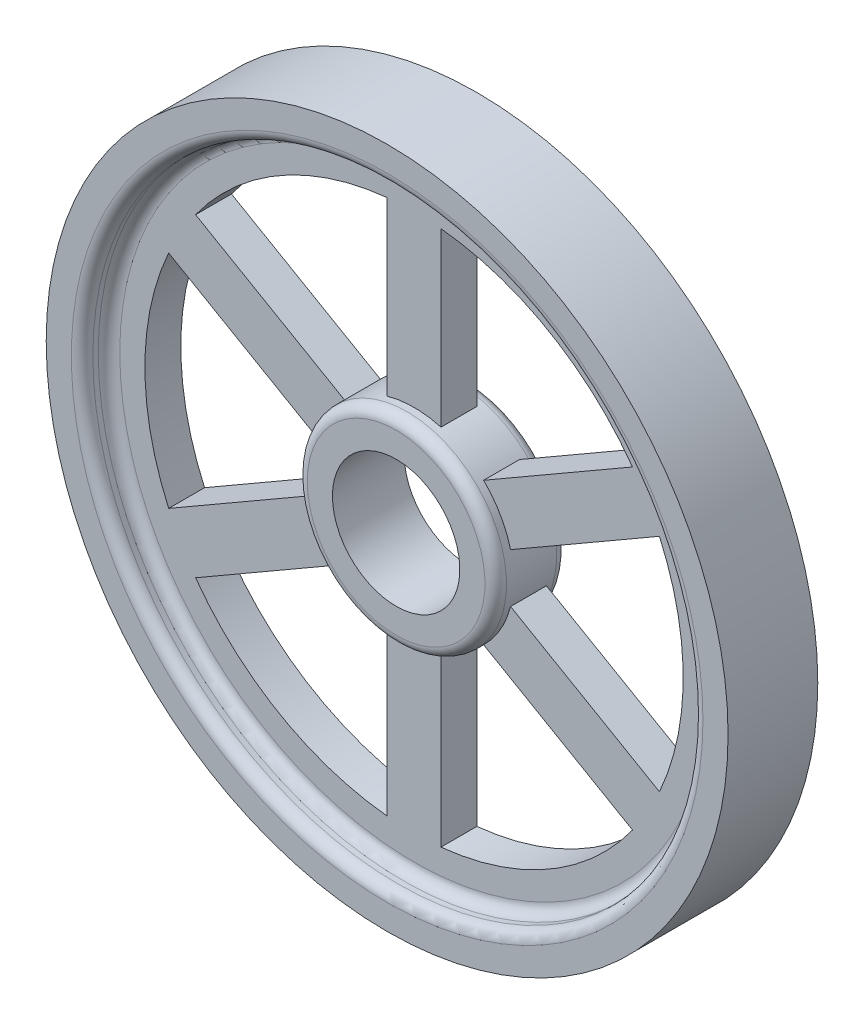
ISO-10303-21;
HEADER;
FILE_DESCRIPTION(('STEP AP214'),'2;1');
FILE_NAME('part.step','',(''),(''),'','','');
FILE_SCHEMA(('AUTOMOTIVE_DESIGN { 1 0 10303 214 1 1 1 1 }'));
ENDSEC;
DATA;
#1=APPLICATION_CONTEXT('core data for automotive mechanical design processes');
#2=APPLICATION_PROTOCOL_DEFINITION('international standard','automotive_design',2000,#1);
#3=PRODUCT_CONTEXT('',#1,'mechanical');
#4=PRODUCT('Part','Part','',(#3));
#5=PRODUCT_RELATED_PRODUCT_CATEGORY('part','',(#4));
#6=PRODUCT_DEFINITION_FORMATION('','',#4);
#7=PRODUCT_DEFINITION_CONTEXT('part definition',#1,'design');
#8=PRODUCT_DEFINITION('design','',#6,#7);
#9=PRODUCT_DEFINITION_SHAPE('','',#8);
#10=(LENGTH_UNIT() NAMED_UNIT(*) SI_UNIT(.MILLI.,.METRE.));
#11=(NAMED_UNIT(*) PLANE_ANGLE_UNIT() SI_UNIT($,.RADIAN.));
#12=(NAMED_UNIT(*) SI_UNIT($,.STERADIAN.) SOLID_ANGLE_UNIT());
#13=UNCERTAINTY_MEASURE_WITH_UNIT(LENGTH_MEASURE(1.E-05),#10,'distance_accuracy_value','');
#14=(GEOMETRIC_REPRESENTATION_CONTEXT(3) GLOBAL_UNCERTAINTY_ASSIGNED_CONTEXT((#13)) GLOBAL_UNIT_ASSIGNED_CONTEXT((#10,
#11,#12)) REPRESENTATION_CONTEXT('',''));
#15=CARTESIAN_POINT('',(0.,0.,0.));
#16=DIRECTION('',(0.,0.,1.));
#17=DIRECTION('',(1.,0.,0.));
#18=AXIS2_PLACEMENT_3D('',#15,#16,#17);
#19=CARTESIAN_POINT('',(0.,0.,22.5));
#20=DIRECTION('',(0.,0.,-1.));
#21=DIRECTION('',(-1.,0.,0.));
#22=AXIS2_PLACEMENT_3D('',#19,#20,#21);
#23=CYLINDRICAL_SURFACE('',#22,27.75);
#24=CARTESIAN_POINT('',(0.,0.,5.5));
#25=DIRECTION('',(0.,0.,-1.));
#26=DIRECTION('',(-1.,0.,0.));
#27=AXIS2_PLACEMENT_3D('',#24,#25,#26);
#28=CIRCLE('',#27,27.75);
#29=CARTESIAN_POINT('',(-27.75,0.,5.5));
#30=VERTEX_POINT('',#29);
#31=EDGE_CURVE('E470',#30,#30,#28,.F.);
#32=ORIENTED_EDGE('',*,*,#31,.T.);
#33=EDGE_LOOP('',(#32));
#34=FACE_BOUND('',#33,.T.);
#35=CARTESIAN_POINT('',(0.,0.,19.5));
#36=DIRECTION('',(0.,0.,-1.));
#37=DIRECTION('',(-1.,0.,0.));
#38=AXIS2_PLACEMENT_3D('',#35,#36,#37);
#39=CIRCLE('',#38,27.75);
#40=CARTESIAN_POINT('',(-27.75,0.,19.5));
#41=VERTEX_POINT('',#40);
#42=EDGE_CURVE('E466',#41,#41,#39,.T.);
#43=ORIENTED_EDGE('',*,*,#42,.T.);
#44=EDGE_LOOP('',(#43));
#45=FACE_BOUND('',#44,.T.);
#46=DIRECTION('',(0.,0.,-1.));
#47=VECTOR('',#46,1.);
#48=CARTESIAN_POINT('',(7.5,26.7172696958353,17.5));
#49=LINE('',#48,#47);
#50=CARTESIAN_POINT('',(7.5,26.7172696958353,17.5));
#51=VERTEX_POINT('',#50);
#52=CARTESIAN_POINT('',(7.5,26.7172696958353,7.5));
#53=VERTEX_POINT('',#52);
#54=EDGE_CURVE('E448',#51,#53,#49,.T.);
#55=ORIENTED_EDGE('',*,*,#54,.F.);
#56=CARTESIAN_POINT('',(0.,0.,17.5));
#57=DIRECTION('',(0.,0.,1.));
#58=DIRECTION('',(-1.,0.,0.));
#59=AXIS2_PLACEMENT_3D('',#56,#57,#58);
#60=CIRCLE('',#59,27.75);
#61=CARTESIAN_POINT('',(-7.5,26.7172696958353,17.5));
#62=VERTEX_POINT('',#61);
#63=EDGE_CURVE('E432',#51,#62,#60,.T.);
#64=ORIENTED_EDGE('',*,*,#63,.T.);
#65=DIRECTION('',(0.,0.,-1.));
#66=VECTOR('',#65,1.);
#67=CARTESIAN_POINT('',(-7.5,26.7172696958353,17.5));
#68=LINE('',#67,#66);
#69=CARTESIAN_POINT('',(-7.5,26.7172696958353,7.5));
#70=VERTEX_POINT('',#69);
#71=EDGE_CURVE('E445',#62,#70,#68,.T.);
#72=ORIENTED_EDGE('',*,*,#71,.T.);
#73=CARTESIAN_POINT('',(0.,0.,7.5));
#74=DIRECTION('',(0.,0.,1.));
#75=DIRECTION('',(-1.,0.,0.));
#76=AXIS2_PLACEMENT_3D('',#73,#74,#75);
#77=CIRCLE('',#76,27.75);
#78=EDGE_CURVE('E421',#53,#70,#77,.T.);
#79=ORIENTED_EDGE('',*,*,#78,.F.);
#80=EDGE_LOOP('',(#55,#64,#72,#79));
#81=FACE_BOUND('',#80,.T.);
#82=DIRECTION('',(0.,0.,-1.));
#83=VECTOR('',#82,1.);
#84=CARTESIAN_POINT('',(-19.3878342763536,19.8538253763009,17.5));
#85=LINE('',#84,#83);
#86=CARTESIAN_POINT('',(-19.3878342763536,19.8538253763009,17.5));
#87=VERTEX_POINT('',#86);
#88=CARTESIAN_POINT('',(-19.3878342763536,19.8538253763009,7.5));
#89=VERTEX_POINT('',#88);
#90=EDGE_CURVE('E396',#87,#89,#85,.T.);
#91=ORIENTED_EDGE('',*,*,#90,.F.);
#92=CARTESIAN_POINT('',(0.,0.,17.5));
#93=DIRECTION('',(0.,0.,1.));
#94=DIRECTION('',(-0.499999999999998,-0.86602540378444,0.));
#95=AXIS2_PLACEMENT_3D('',#92,#93,#94);
#96=CIRCLE('',#95,27.75);
#97=CARTESIAN_POINT('',(-26.8878342763535,6.8634443195343,17.5));
#98=VERTEX_POINT('',#97);
#99=EDGE_CURVE('E380',#87,#98,#96,.T.);
#100=ORIENTED_EDGE('',*,*,#99,.T.);
#101=DIRECTION('',(0.,0.,-1.));
#102=VECTOR('',#101,1.);
#103=CARTESIAN_POINT('',(-26.8878342763535,6.86344431953431,17.5));
#104=LINE('',#103,#102);
#105=CARTESIAN_POINT('',(-26.8878342763535,6.86344431953431,7.5));
#106=VERTEX_POINT('',#105);
#107=EDGE_CURVE('E393',#98,#106,#104,.T.);
#108=ORIENTED_EDGE('',*,*,#107,.T.);
#109=CARTESIAN_POINT('',(0.,0.,7.5));
#110=DIRECTION('',(0.,0.,1.));
#111=DIRECTION('',(-0.499999999999998,-0.86602540378444,0.));
#112=AXIS2_PLACEMENT_3D('',#109,#110,#111);
#113=CIRCLE('',#112,27.75);
#114=EDGE_CURVE('E368',#89,#106,#113,.T.);
#115=ORIENTED_EDGE('',*,*,#114,.F.);
#116=EDGE_LOOP('',(#91,#100,#108,#115));
#117=FACE_BOUND('',#116,.T.);
#118=DIRECTION('',(0.,0.,-1.));
#119=VECTOR('',#118,1.);
#120=CARTESIAN_POINT('',(-26.8878342763535,-6.8634443195345,17.5));
#121=LINE('',#120,#119);
#122=CARTESIAN_POINT('',(-26.8878342763535,-6.86344431953449,17.5));
#123=VERTEX_POINT('',#122);
#124=CARTESIAN_POINT('',(-26.8878342763535,-6.86344431953449,7.5));
#125=VERTEX_POINT('',#124);
#126=EDGE_CURVE('E358',#123,#125,#121,.T.);
#127=ORIENTED_EDGE('',*,*,#126,.F.);
#128=CARTESIAN_POINT('',(0.,0.,17.5));
#129=DIRECTION('',(0.,0.,1.));
#130=DIRECTION('',(0.500000000000004,-0.866025403784436,0.));
#131=AXIS2_PLACEMENT_3D('',#128,#129,#130);
#132=CIRCLE('',#131,27.75);
#133=CARTESIAN_POINT('',(-19.3878342763534,-19.853825376301,17.5));
#134=VERTEX_POINT('',#133);
#135=EDGE_CURVE('E342',#123,#134,#132,.T.);
#136=ORIENTED_EDGE('',*,*,#135,.T.);
#137=DIRECTION('',(0.,0.,-1.));
#138=VECTOR('',#137,1.);
#139=CARTESIAN_POINT('',(-19.3878342763534,-19.853825376301,17.5));
#140=LINE('',#139,#138);
#141=CARTESIAN_POINT('',(-19.3878342763534,-19.853825376301,7.5));
#142=VERTEX_POINT('',#141);
#143=EDGE_CURVE('E355',#134,#142,#140,.T.);
#144=ORIENTED_EDGE('',*,*,#143,.T.);
#145=CARTESIAN_POINT('',(0.,0.,7.5));
#146=DIRECTION('',(0.,0.,1.));
#147=DIRECTION('',(0.500000000000004,-0.866025403784436,0.));
#148=AXIS2_PLACEMENT_3D('',#145,#146,#147);
#149=CIRCLE('',#148,27.75);
#150=EDGE_CURVE('E330',#125,#142,#149,.T.);
#151=ORIENTED_EDGE('',*,*,#150,.F.);
#152=EDGE_LOOP('',(#127,#136,#144,#151));
#153=FACE_BOUND('',#152,.T.);
#154=DIRECTION('',(0.,0.,-1.));
#155=VECTOR('',#154,1.);
#156=CARTESIAN_POINT('',(-7.5,-26.7172696958353,17.5));
#157=LINE('',#156,#155);
#158=CARTESIAN_POINT('',(-7.5,-26.7172696958353,17.5));
#159=VERTEX_POINT('',#158);
#160=CARTESIAN_POINT('',(-7.5,-26.7172696958353,7.5));
#161=VERTEX_POINT('',#160);
#162=EDGE_CURVE('E320',#159,#161,#157,.T.);
#163=ORIENTED_EDGE('',*,*,#162,.F.);
#164=CARTESIAN_POINT('',(0.,0.,17.5));
#165=DIRECTION('',(0.,0.,1.));
#166=DIRECTION('',(1.,0.,0.));
#167=AXIS2_PLACEMENT_3D('',#164,#165,#166);
#168=CIRCLE('',#167,27.75);
#169=CARTESIAN_POINT('',(7.5,-26.7172696958353,17.5));
#170=VERTEX_POINT('',#169);
#171=EDGE_CURVE('E304',#159,#170,#168,.T.);
#172=ORIENTED_EDGE('',*,*,#171,.T.);
#173=DIRECTION('',(0.,0.,-1.));
#174=VECTOR('',#173,1.);
#175=CARTESIAN_POINT('',(7.5,-26.7172696958353,17.5));
#176=LINE('',#175,#174);
#177=CARTESIAN_POINT('',(7.5,-26.7172696958353,7.5));
#178=VERTEX_POINT('',#177);
#179=EDGE_CURVE('E317',#170,#178,#176,.T.);
#180=ORIENTED_EDGE('',*,*,#179,.T.);
#181=CARTESIAN_POINT('',(0.,0.,7.5));
#182=DIRECTION('',(0.,0.,1.));
#183=DIRECTION('',(1.,0.,0.));
#184=AXIS2_PLACEMENT_3D('',#181,#182,#183);
#185=CIRCLE('',#184,27.75);
#186=EDGE_CURVE('E292',#161,#178,#185,.T.);
#187=ORIENTED_EDGE('',*,*,#186,.F.);
#188=EDGE_LOOP('',(#163,#172,#180,#187));
#189=FACE_BOUND('',#188,.T.);
#190=DIRECTION('',(0.,0.,-1.));
#191=VECTOR('',#190,1.);
#192=CARTESIAN_POINT('',(19.3878342763537,-19.8538253763008,17.5));
#193=LINE('',#192,#191);
#194=CARTESIAN_POINT('',(19.3878342763537,-19.8538253763008,17.5));
#195=VERTEX_POINT('',#194);
#196=CARTESIAN_POINT('',(19.3878342763537,-19.8538253763008,7.5));
#197=VERTEX_POINT('',#196);
#198=EDGE_CURVE('E282',#195,#197,#193,.T.);
#199=ORIENTED_EDGE('',*,*,#198,.F.);
#200=CARTESIAN_POINT('',(0.,0.,17.5));
#201=DIRECTION('',(0.,0.,1.));
#202=DIRECTION('',(0.499999999999992,0.866025403784443,0.));
#203=AXIS2_PLACEMENT_3D('',#200,#201,#202);
#204=CIRCLE('',#203,27.75);
#205=CARTESIAN_POINT('',(26.8878342763536,-6.86344431953412,17.5));
#206=VERTEX_POINT('',#205);
#207=EDGE_CURVE('E267',#195,#206,#204,.T.);
#208=ORIENTED_EDGE('',*,*,#207,.T.);
#209=DIRECTION('',(0.,0.,-1.));
#210=VECTOR('',#209,1.);
#211=CARTESIAN_POINT('',(26.8878342763536,-6.86344431953412,17.5));
#212=LINE('',#211,#210);
#213=CARTESIAN_POINT('',(26.8878342763536,-6.86344431953412,7.5));
#214=VERTEX_POINT('',#213);
#215=EDGE_CURVE('E279',#206,#214,#212,.T.);
#216=ORIENTED_EDGE('',*,*,#215,.T.);
#217=CARTESIAN_POINT('',(0.,0.,7.5));
#218=DIRECTION('',(0.,0.,1.));
#219=DIRECTION('',(0.499999999999992,0.866025403784443,0.));
#220=AXIS2_PLACEMENT_3D('',#217,#218,#219);
#221=CIRCLE('',#220,27.75);
#222=EDGE_CURVE('E258',#197,#214,#221,.T.);
#223=ORIENTED_EDGE('',*,*,#222,.F.);
#224=EDGE_LOOP('',(#199,#208,#216,#223));
#225=FACE_BOUND('',#224,.T.);
#226=DIRECTION('',(0.,0.,-1.));
#227=VECTOR('',#226,1.);
#228=CARTESIAN_POINT('',(26.8878342763534,6.86344431953468,17.5));
#229=LINE('',#228,#227);
#230=CARTESIAN_POINT('',(26.8878342763534,6.86344431953468,17.5));
#231=VERTEX_POINT('',#230);
#232=CARTESIAN_POINT('',(26.8878342763534,6.86344431953468,7.5));
#233=VERTEX_POINT('',#232);
#234=EDGE_CURVE('E60',#231,#233,#229,.T.);
#235=ORIENTED_EDGE('',*,*,#234,.F.);
#236=CARTESIAN_POINT('',(0.,0.,17.5));
#237=DIRECTION('',(0.,0.,1.));
#238=DIRECTION('',(-0.50000000000001,0.866025403784433,0.));
#239=AXIS2_PLACEMENT_3D('',#236,#237,#238);
#240=CIRCLE('',#239,27.75);
#241=CARTESIAN_POINT('',(19.3878342763533,19.8538253763012,17.5));
#242=VERTEX_POINT('',#241);
#243=EDGE_CURVE('E55',#231,#242,#240,.T.);
#244=ORIENTED_EDGE('',*,*,#243,.T.);
#245=DIRECTION('',(0.,0.,-1.));
#246=VECTOR('',#245,1.);
#247=CARTESIAN_POINT('',(19.3878342763533,19.8538253763012,17.5));
#248=LINE('',#247,#246);
#249=CARTESIAN_POINT('',(19.3878342763533,19.8538253763012,7.5));
#250=VERTEX_POINT('',#249);
#251=EDGE_CURVE('E250',#242,#250,#248,.T.);
#252=ORIENTED_EDGE('',*,*,#251,.T.);
#253=CARTESIAN_POINT('',(0.,0.,7.5));
#254=DIRECTION('',(0.,0.,1.));
#255=DIRECTION('',(-0.50000000000001,0.866025403784433,0.));
#256=AXIS2_PLACEMENT_3D('',#253,#254,#255);
#257=CIRCLE('',#256,27.75);
#258=EDGE_CURVE('E228',#233,#250,#257,.T.);
#259=ORIENTED_EDGE('',*,*,#258,.F.);
#260=EDGE_LOOP('',(#235,#244,#252,#259));
#261=FACE_BOUND('',#260,.T.);
#262=ADVANCED_FACE('F39',(#34,#45,#81,#117,#153,#189,#225,#261),#23,.T.);
#263=CARTESIAN_POINT('',(0.,0.,17.5));
#264=DIRECTION('',(0.,0.,-1.));
#265=DIRECTION('',(-1.,0.,0.));
#266=AXIS2_PLACEMENT_3D('',#263,#264,#265);
#267=CYLINDRICAL_SURFACE('',#266,75.);
#268=CARTESIAN_POINT('',(0.,0.,7.5));
#269=DIRECTION('',(0.,0.,-1.));
#270=DIRECTION('',(-1.,0.,0.));
#271=AXIS2_PLACEMENT_3D('',#268,#269,#270);
#272=CIRCLE('',#271,75.);
#273=CARTESIAN_POINT('',(7.5,74.6240577829965,7.5));
#274=VERTEX_POINT('',#273);
#275=CARTESIAN_POINT('',(60.8763297735523,43.8072194198823,7.5));
#276=VERTEX_POINT('',#275);
#277=EDGE_CURVE('E213',#274,#276,#272,.T.);
#278=ORIENTED_EDGE('',*,*,#277,.T.);
#279=DIRECTION('',(0.,0.,-1.));
#280=VECTOR('',#279,1.);
#281=CARTESIAN_POINT('',(60.8763297735523,43.8072194198823,17.5));
#282=LINE('',#281,#280);
#283=CARTESIAN_POINT('',(60.8763297735523,43.8072194198823,17.5));
#284=VERTEX_POINT('',#283);
#285=EDGE_CURVE('E245',#284,#276,#282,.T.);
#286=ORIENTED_EDGE('',*,*,#285,.F.);
#287=CARTESIAN_POINT('',(0.,0.,17.5));
#288=DIRECTION('',(0.,0.,-1.));
#289=DIRECTION('',(-1.,0.,0.));
#290=AXIS2_PLACEMENT_3D('',#287,#288,#289);
#291=CIRCLE('',#290,75.);
#292=CARTESIAN_POINT('',(7.5,74.6240577829965,17.5));
#293=VERTEX_POINT('',#292);
#294=EDGE_CURVE('E405',#293,#284,#291,.T.);
#295=ORIENTED_EDGE('',*,*,#294,.F.);
#296=DIRECTION('',(0.,0.,-1.));
#297=VECTOR('',#296,1.);
#298=CARTESIAN_POINT('',(7.5,74.6240577829965,17.5));
#299=LINE('',#298,#297);
#300=EDGE_CURVE('E439',#293,#274,#299,.T.);
#301=ORIENTED_EDGE('',*,*,#300,.T.);
#302=EDGE_LOOP('',(#278,#286,#295,#301));
#303=FACE_BOUND('',#302,.T.);
#304=ADVANCED_FACE('F523',(#303),#267,.F.);
#305=CARTESIAN_POINT('',(68.3763297735525,30.8168383631158,17.5));
#306=VERTEX_POINT('',#305);
#307=CARTESIAN_POINT('',(68.3763297735531,-30.8168383631143,17.5));
#308=VERTEX_POINT('',#307);
#309=EDGE_CURVE('E219',#306,#308,#291,.T.);
#310=ORIENTED_EDGE('',*,*,#309,.F.);
#311=DIRECTION('',(0.,0.,-1.));
#312=VECTOR('',#311,1.);
#313=CARTESIAN_POINT('',(68.3763297735525,30.8168383631158,17.5));
#314=LINE('',#313,#312);
#315=CARTESIAN_POINT('',(68.3763297735525,30.8168383631158,7.5));
#316=VERTEX_POINT('',#315);
#317=EDGE_CURVE('E217',#306,#316,#314,.T.);
#318=ORIENTED_EDGE('',*,*,#317,.T.);
#319=CARTESIAN_POINT('',(68.3763297735531,-30.8168383631143,7.5));
#320=VERTEX_POINT('',#319);
#321=EDGE_CURVE('E199',#316,#320,#272,.T.);
#322=ORIENTED_EDGE('',*,*,#321,.T.);
#323=DIRECTION('',(0.,0.,-1.));
#324=VECTOR('',#323,1.);
#325=CARTESIAN_POINT('',(68.3763297735531,-30.8168383631143,17.5));
#326=LINE('',#325,#324);
#327=EDGE_CURVE('E275',#308,#320,#326,.T.);
#328=ORIENTED_EDGE('',*,*,#327,.F.);
#329=EDGE_LOOP('',(#310,#318,#322,#328));
#330=FACE_BOUND('',#329,.T.);
#331=ADVANCED_FACE('F218',(#330),#267,.F.);
#332=CARTESIAN_POINT('',(60.8763297735532,-43.807219419881,17.5));
#333=VERTEX_POINT('',#332);
#334=CARTESIAN_POINT('',(7.5,-74.6240577829965,17.5));
#335=VERTEX_POINT('',#334);
#336=EDGE_CURVE('E638',#333,#335,#291,.T.);
#337=ORIENTED_EDGE('',*,*,#336,.F.);
#338=DIRECTION('',(0.,0.,-1.));
#339=VECTOR('',#338,1.);
#340=CARTESIAN_POINT('',(60.8763297735533,-43.807219419881,17.5));
#341=LINE('',#340,#339);
#342=CARTESIAN_POINT('',(60.8763297735533,-43.807219419881,7.5));
#343=VERTEX_POINT('',#342);
#344=EDGE_CURVE('E274',#333,#343,#341,.T.);
#345=ORIENTED_EDGE('',*,*,#344,.T.);
#346=CARTESIAN_POINT('',(7.5,-74.6240577829965,7.5));
#347=VERTEX_POINT('',#346);
#348=EDGE_CURVE('E214',#343,#347,#272,.T.);
#349=ORIENTED_EDGE('',*,*,#348,.T.);
#350=DIRECTION('',(0.,0.,-1.));
#351=VECTOR('',#350,1.);
#352=CARTESIAN_POINT('',(7.5,-74.6240577829965,17.5));
#353=LINE('',#352,#351);
#354=EDGE_CURVE('E312',#335,#347,#353,.T.);
#355=ORIENTED_EDGE('',*,*,#354,.F.);
#356=EDGE_LOOP('',(#337,#345,#349,#355));
#357=FACE_BOUND('',#356,.T.);
#358=ADVANCED_FACE('F636',(#357),#267,.F.);
#359=CARTESIAN_POINT('',(-7.5,-74.6240577829965,17.5));
#360=VERTEX_POINT('',#359);
#361=CARTESIAN_POINT('',(-60.8763297735526,-43.8072194198818,17.5));
#362=VERTEX_POINT('',#361);
#363=EDGE_CURVE('E641',#360,#362,#291,.T.);
#364=ORIENTED_EDGE('',*,*,#363,.F.);
#365=DIRECTION('',(0.,0.,-1.));
#366=VECTOR('',#365,1.);
#367=CARTESIAN_POINT('',(-7.5,-74.6240577829965,17.5));
#368=LINE('',#367,#366);
#369=CARTESIAN_POINT('',(-7.5,-74.6240577829965,7.5));
#370=VERTEX_POINT('',#369);
#371=EDGE_CURVE('E311',#360,#370,#368,.T.);
#372=ORIENTED_EDGE('',*,*,#371,.T.);
#373=CARTESIAN_POINT('',(-60.8763297735526,-43.8072194198818,7.5));
#374=VERTEX_POINT('',#373);
#375=EDGE_CURVE('E867',#370,#374,#272,.T.);
#376=ORIENTED_EDGE('',*,*,#375,.T.);
#377=DIRECTION('',(0.,0.,-1.));
#378=VECTOR('',#377,1.);
#379=CARTESIAN_POINT('',(-60.8763297735527,-43.8072194198818,17.5));
#380=LINE('',#379,#378);
#381=EDGE_CURVE('E350',#362,#374,#380,.T.);
#382=ORIENTED_EDGE('',*,*,#381,.F.);
#383=EDGE_LOOP('',(#364,#372,#376,#382));
#384=FACE_BOUND('',#383,.T.);
#385=ADVANCED_FACE('F611',(#384),#267,.F.);
#386=CARTESIAN_POINT('',(-68.3763297735527,-30.8168383631153,17.5));
#387=VERTEX_POINT('',#386);
#388=CARTESIAN_POINT('',(-68.3763297735529,30.8168383631148,17.5));
#389=VERTEX_POINT('',#388);
#390=EDGE_CURVE('E644',#387,#389,#291,.T.);
#391=ORIENTED_EDGE('',*,*,#390,.F.);
#392=DIRECTION('',(0.,0.,-1.));
#393=VECTOR('',#392,1.);
#394=CARTESIAN_POINT('',(-68.3763297735527,-30.8168383631153,17.5));
#395=LINE('',#394,#393);
#396=CARTESIAN_POINT('',(-68.3763297735527,-30.8168383631153,7.5));
#397=VERTEX_POINT('',#396);
#398=EDGE_CURVE('E349',#387,#397,#395,.T.);
#399=ORIENTED_EDGE('',*,*,#398,.T.);
#400=CARTESIAN_POINT('',(-68.3763297735529,30.8168383631148,7.5));
#401=VERTEX_POINT('',#400);
#402=EDGE_CURVE('E870',#397,#401,#272,.T.);
#403=ORIENTED_EDGE('',*,*,#402,.T.);
#404=DIRECTION('',(0.,0.,-1.));
#405=VECTOR('',#404,1.);
#406=CARTESIAN_POINT('',(-68.3763297735529,30.8168383631148,17.5));
#407=LINE('',#406,#405);
#408=EDGE_CURVE('E388',#389,#401,#407,.T.);
#409=ORIENTED_EDGE('',*,*,#408,.F.);
#410=EDGE_LOOP('',(#391,#399,#403,#409));
#411=FACE_BOUND('',#410,.T.);
#412=ADVANCED_FACE('F601',(#411),#267,.F.);
#413=CARTESIAN_POINT('',(0.,0.,22.5));
#414=DIRECTION('',(0.,0.,-1.));
#415=DIRECTION('',(-1.,0.,0.));
#416=AXIS2_PLACEMENT_3D('',#413,#414,#415);
#417=PLANE('',#416);
#418=CARTESIAN_POINT('',(0.,0.,22.5));
#419=DIRECTION('',(0.,0.,-1.));
#420=DIRECTION('',(-1.,0.,0.));
#421=AXIS2_PLACEMENT_3D('',#418,#419,#420);
#422=CIRCLE('',#421,24.75);
#423=CARTESIAN_POINT('',(-24.75,0.,22.5));
#424=VERTEX_POINT('',#423);
#425=EDGE_CURVE('E474',#424,#424,#422,.F.);
#426=ORIENTED_EDGE('',*,*,#425,.T.);
#427=EDGE_LOOP('',(#426));
#428=FACE_BOUND('',#427,.T.);
#429=CARTESIAN_POINT('',(0.,0.,22.5));
#430=DIRECTION('',(0.,0.,-1.));
#431=DIRECTION('',(-1.,0.,0.));
#432=AXIS2_PLACEMENT_3D('',#429,#430,#431);
#433=CIRCLE('',#432,17.75);
#434=CARTESIAN_POINT('',(-17.75,0.,22.5));
#435=VERTEX_POINT('',#434);
#436=EDGE_CURVE('E458',#435,#435,#433,.T.);
#437=ORIENTED_EDGE('',*,*,#436,.T.);
#438=EDGE_LOOP('',(#437));
#439=FACE_BOUND('',#438,.T.);
#440=ADVANCED_FACE('F535',(#428,#439),#417,.F.);
#441=CARTESIAN_POINT('',(0.,0.,22.5));
#442=DIRECTION('',(0.,0.,-1.));
#443=DIRECTION('',(-1.,0.,0.));
#444=AXIS2_PLACEMENT_3D('',#441,#442,#443);
#445=CYLINDRICAL_SURFACE('',#444,17.75);
#446=ORIENTED_EDGE('',*,*,#436,.F.);
#447=EDGE_LOOP('',(#446));
#448=FACE_BOUND('',#447,.T.);
#449=CARTESIAN_POINT('',(0.,0.,2.5));
#450=DIRECTION('',(0.,0.,-1.));
#451=DIRECTION('',(-1.,0.,0.));
#452=AXIS2_PLACEMENT_3D('',#449,#450,#451);
#453=CIRCLE('',#452,17.75);
#454=CARTESIAN_POINT('',(-17.75,0.,2.5));
#455=VERTEX_POINT('',#454);
#456=EDGE_CURVE('E444',#455,#455,#453,.T.);
#457=ORIENTED_EDGE('',*,*,#456,.T.);
#458=EDGE_LOOP('',(#457));
#459=FACE_BOUND('',#458,.T.);
#460=ADVANCED_FACE('F594',(#448,#459),#445,.F.);
#461=CARTESIAN_POINT('',(0.,0.,2.5));
#462=DIRECTION('',(0.,0.,-1.));
#463=DIRECTION('',(-1.,0.,0.));
#464=AXIS2_PLACEMENT_3D('',#461,#462,#463);
#465=PLANE('',#464);
#466=CARTESIAN_POINT('',(0.,0.,2.5));
#467=DIRECTION('',(0.,0.,-1.));
#468=DIRECTION('',(-1.,0.,0.));
#469=AXIS2_PLACEMENT_3D('',#466,#467,#468);
#470=CIRCLE('',#469,24.75);
#471=CARTESIAN_POINT('',(-24.75,0.,2.5));
#472=VERTEX_POINT('',#471);
#473=EDGE_CURVE('E462',#472,#472,#470,.T.);
#474=ORIENTED_EDGE('',*,*,#473,.T.);
#475=EDGE_LOOP('',(#474));
#476=FACE_BOUND('',#475,.T.);
#477=ORIENTED_EDGE('',*,*,#456,.F.);
#478=EDGE_LOOP('',(#477));
#479=FACE_BOUND('',#478,.T.);
#480=ADVANCED_FACE('F541',(#476,#479),#465,.T.);
#481=CARTESIAN_POINT('',(0.,0.,5.5));
#482=DIRECTION('',(0.,0.,-1.));
#483=DIRECTION('',(-1.,0.,0.));
#484=AXIS2_PLACEMENT_3D('',#481,#482,#483);
#485=TOROIDAL_SURFACE('',#484,24.75,3.);
#486=ORIENTED_EDGE('',*,*,#31,.F.);
#487=EDGE_LOOP('',(#486));
#488=FACE_BOUND('',#487,.T.);
#489=ORIENTED_EDGE('',*,*,#473,.F.);
#490=EDGE_LOOP('',(#489));
#491=FACE_BOUND('',#490,.T.);
#492=ADVANCED_FACE('F537',(#488,#491),#485,.T.);
#493=CARTESIAN_POINT('',(0.,0.,19.5));
#494=DIRECTION('',(0.,0.,-1.));
#495=DIRECTION('',(-1.,0.,0.));
#496=AXIS2_PLACEMENT_3D('',#493,#494,#495);
#497=TOROIDAL_SURFACE('',#496,24.75,3.);
#498=ORIENTED_EDGE('',*,*,#425,.F.);
#499=EDGE_LOOP('',(#498));
#500=FACE_BOUND('',#499,.T.);
#501=ORIENTED_EDGE('',*,*,#42,.F.);
#502=EDGE_LOOP('',(#501));
#503=FACE_BOUND('',#502,.T.);
#504=ADVANCED_FACE('F540',(#500,#503),#497,.T.);
#505=CARTESIAN_POINT('',(-7.5,26.7172696958353,17.5));
#506=DIRECTION('',(-1.,0.,0.));
#507=DIRECTION('',(0.,0.,1.));
#508=AXIS2_PLACEMENT_3D('',#505,#506,#507);
#509=PLANE('',#508);
#510=DIRECTION('',(0.,0.,-1.));
#511=VECTOR('',#510,1.);
#512=CARTESIAN_POINT('',(-7.5,74.6240577829965,17.5));
#513=LINE('',#512,#511);
#514=CARTESIAN_POINT('',(-7.5,74.6240577829965,17.5));
#515=VERTEX_POINT('',#514);
#516=CARTESIAN_POINT('',(-7.5,74.6240577829965,7.5));
#517=VERTEX_POINT('',#516);
#518=EDGE_CURVE('E440',#515,#517,#513,.T.);
#519=ORIENTED_EDGE('',*,*,#518,.T.);
#520=DIRECTION('',(0.,1.,0.));
#521=VECTOR('',#520,1.);
#522=CARTESIAN_POINT('',(-7.5,26.7172696958353,7.5));
#523=LINE('',#522,#521);
#524=EDGE_CURVE('E425',#70,#517,#523,.T.);
#525=ORIENTED_EDGE('',*,*,#524,.F.);
#526=ORIENTED_EDGE('',*,*,#71,.F.);
#527=DIRECTION('',(0.,1.,0.));
#528=VECTOR('',#527,1.);
#529=CARTESIAN_POINT('',(-7.5,26.7172696958353,17.5));
#530=LINE('',#529,#528);
#531=EDGE_CURVE('E435',#62,#515,#530,.T.);
#532=ORIENTED_EDGE('',*,*,#531,.T.);
#533=EDGE_LOOP('',(#519,#525,#526,#532));
#534=FACE_BOUND('',#533,.T.);
#535=ADVANCED_FACE('F545',(#534),#509,.T.);
#536=CARTESIAN_POINT('',(7.5,26.7172696958353,17.5));
#537=DIRECTION('',(1.,0.,0.));
#538=DIRECTION('',(0.,0.,-1.));
#539=AXIS2_PLACEMENT_3D('',#536,#537,#538);
#540=PLANE('',#539);
#541=ORIENTED_EDGE('',*,*,#54,.T.);
#542=DIRECTION('',(0.,-1.,0.));
#543=VECTOR('',#542,1.);
#544=CARTESIAN_POINT('',(7.5,26.7172696958353,7.5));
#545=LINE('',#544,#543);
#546=EDGE_CURVE('E414',#274,#53,#545,.T.);
#547=ORIENTED_EDGE('',*,*,#546,.F.);
#548=ORIENTED_EDGE('',*,*,#300,.F.);
#549=DIRECTION('',(0.,-1.,0.));
#550=VECTOR('',#549,1.);
#551=CARTESIAN_POINT('',(7.5,26.7172696958353,17.5));
#552=LINE('',#551,#550);
#553=EDGE_CURVE('E428',#293,#51,#552,.T.);
#554=ORIENTED_EDGE('',*,*,#553,.T.);
#555=EDGE_LOOP('',(#541,#547,#548,#554));
#556=FACE_BOUND('',#555,.T.);
#557=ADVANCED_FACE('F585',(#556),#540,.T.);
#558=CARTESIAN_POINT('',(0.,0.,17.5));
#559=DIRECTION('',(0.,0.,-1.));
#560=DIRECTION('',(-1.,0.,0.));
#561=AXIS2_PLACEMENT_3D('',#558,#559,#560);
#562=PLANE('',#561);
#563=CARTESIAN_POINT('',(0.,0.,17.5));
#564=DIRECTION('',(0.,0.,-1.));
#565=DIRECTION('',(-1.,0.,0.));
#566=AXIS2_PLACEMENT_3D('',#563,#564,#565);
#567=CIRCLE('',#566,82.);
#568=CARTESIAN_POINT('',(-82.,0.,17.5));
#569=VERTEX_POINT('',#568);
#570=EDGE_CURVE('E11',#569,#569,#567,.F.);
#571=ORIENTED_EDGE('',*,*,#570,.T.);
#572=EDGE_LOOP('',(#571));
#573=FACE_BOUND('',#572,.T.);
#574=ORIENTED_EDGE('',*,*,#553,.F.);
#575=ORIENTED_EDGE('',*,*,#294,.T.);
#576=DIRECTION('',(0.866025403784433,0.50000000000001,0.));
#577=VECTOR('',#576,1.);
#578=CARTESIAN_POINT('',(19.3878342763533,19.8538253763012,17.5));
#579=LINE('',#578,#577);
#580=EDGE_CURVE('E224',#242,#284,#579,.T.);
#581=ORIENTED_EDGE('',*,*,#580,.F.);
#582=ORIENTED_EDGE('',*,*,#243,.F.);
#583=DIRECTION('',(-0.866025403784433,-0.50000000000001,0.));
#584=VECTOR('',#583,1.);
#585=CARTESIAN_POINT('',(26.8878342763534,6.86344431953468,17.5));
#586=LINE('',#585,#584);
#587=EDGE_CURVE('E237',#306,#231,#586,.T.);
#588=ORIENTED_EDGE('',*,*,#587,.F.);
#589=ORIENTED_EDGE('',*,*,#309,.T.);
#590=DIRECTION('',(0.866025403784443,-0.499999999999992,0.));
#591=VECTOR('',#590,1.);
#592=CARTESIAN_POINT('',(26.8878342763536,-6.86344431953412,17.5));
#593=LINE('',#592,#591);
#594=EDGE_CURVE('E270',#206,#308,#593,.T.);
#595=ORIENTED_EDGE('',*,*,#594,.F.);
#596=ORIENTED_EDGE('',*,*,#207,.F.);
#597=DIRECTION('',(-0.866025403784443,0.499999999999992,0.));
#598=VECTOR('',#597,1.);
#599=CARTESIAN_POINT('',(19.3878342763537,-19.8538253763008,17.5));
#600=LINE('',#599,#598);
#601=EDGE_CURVE('E263',#333,#195,#600,.T.);
#602=ORIENTED_EDGE('',*,*,#601,.F.);
#603=ORIENTED_EDGE('',*,*,#336,.T.);
#604=DIRECTION('',(0.,-1.,0.));
#605=VECTOR('',#604,1.);
#606=CARTESIAN_POINT('',(7.5,-26.7172696958353,17.5));
#607=LINE('',#606,#605);
#608=EDGE_CURVE('E307',#170,#335,#607,.T.);
#609=ORIENTED_EDGE('',*,*,#608,.F.);
#610=ORIENTED_EDGE('',*,*,#171,.F.);
#611=DIRECTION('',(0.,1.,0.));
#612=VECTOR('',#611,1.);
#613=CARTESIAN_POINT('',(-7.5,-26.7172696958353,17.5));
#614=LINE('',#613,#612);
#615=EDGE_CURVE('E300',#360,#159,#614,.T.);
#616=ORIENTED_EDGE('',*,*,#615,.F.);
#617=ORIENTED_EDGE('',*,*,#363,.T.);
#618=DIRECTION('',(-0.866025403784436,-0.500000000000004,0.));
#619=VECTOR('',#618,1.);
#620=CARTESIAN_POINT('',(-19.3878342763534,-19.853825376301,17.5));
#621=LINE('',#620,#619);
#622=EDGE_CURVE('E345',#134,#362,#621,.T.);
#623=ORIENTED_EDGE('',*,*,#622,.F.);
#624=ORIENTED_EDGE('',*,*,#135,.F.);
#625=DIRECTION('',(0.866025403784436,0.500000000000004,0.));
#626=VECTOR('',#625,1.);
#627=CARTESIAN_POINT('',(-26.8878342763535,-6.8634443195345,17.5));
#628=LINE('',#627,#626);
#629=EDGE_CURVE('E338',#387,#123,#628,.T.);
#630=ORIENTED_EDGE('',*,*,#629,.F.);
#631=ORIENTED_EDGE('',*,*,#390,.T.);
#632=DIRECTION('',(-0.86602540378444,0.499999999999998,0.));
#633=VECTOR('',#632,1.);
#634=CARTESIAN_POINT('',(-26.8878342763535,6.86344431953431,17.5));
#635=LINE('',#634,#633);
#636=EDGE_CURVE('E383',#98,#389,#635,.T.);
#637=ORIENTED_EDGE('',*,*,#636,.F.);
#638=ORIENTED_EDGE('',*,*,#99,.F.);
#639=DIRECTION('',(0.86602540378444,-0.499999999999998,0.));
#640=VECTOR('',#639,1.);
#641=CARTESIAN_POINT('',(-19.3878342763536,19.8538253763009,17.5));
#642=LINE('',#641,#640);
#643=CARTESIAN_POINT('',(-60.8763297735529,43.8072194198814,17.5));
#644=VERTEX_POINT('',#643);
#645=EDGE_CURVE('E376',#644,#87,#642,.T.);
#646=ORIENTED_EDGE('',*,*,#645,.F.);
#647=EDGE_CURVE('E404',#644,#515,#291,.T.);
#648=ORIENTED_EDGE('',*,*,#647,.T.);
#649=ORIENTED_EDGE('',*,*,#531,.F.);
#650=ORIENTED_EDGE('',*,*,#63,.F.);
#651=EDGE_LOOP('',(#574,#575,#581,#582,#588,#589,#595,#596,#602,#603,#609,#610,#616,#617,#623,
#624,#630,#631,#637,#638,#646,#648,#649,#650));
#652=FACE_BOUND('',#651,.T.);
#653=ADVANCED_FACE('F581',(#573,#652),#562,.F.);
#654=CARTESIAN_POINT('',(0.,0.,7.5));
#655=DIRECTION('',(0.,0.,-1.));
#656=DIRECTION('',(-1.,0.,0.));
#657=AXIS2_PLACEMENT_3D('',#654,#655,#656);
#658=PLANE('',#657);
#659=CARTESIAN_POINT('',(0.,0.,7.5));
#660=DIRECTION('',(0.,0.,-1.));
#661=DIRECTION('',(-1.,0.,0.));
#662=AXIS2_PLACEMENT_3D('',#659,#660,#661);
#663=CIRCLE('',#662,82.);
#664=CARTESIAN_POINT('',(-82.,0.,7.5));
#665=VERTEX_POINT('',#664);
#666=EDGE_CURVE('E494',#665,#665,#663,.T.);
#667=ORIENTED_EDGE('',*,*,#666,.T.);
#668=EDGE_LOOP('',(#667));
#669=FACE_BOUND('',#668,.T.);
#670=ORIENTED_EDGE('',*,*,#524,.T.);
#671=CARTESIAN_POINT('',(-60.8763297735529,43.8072194198814,7.5));
#672=VERTEX_POINT('',#671);
#673=EDGE_CURVE('E392',#672,#517,#272,.T.);
#674=ORIENTED_EDGE('',*,*,#673,.F.);
#675=DIRECTION('',(0.86602540378444,-0.499999999999998,0.));
#676=VECTOR('',#675,1.);
#677=CARTESIAN_POINT('',(-19.3878342763536,19.8538253763009,7.5));
#678=LINE('',#677,#676);
#679=EDGE_CURVE('E354',#672,#89,#678,.T.);
#680=ORIENTED_EDGE('',*,*,#679,.T.);
#681=ORIENTED_EDGE('',*,*,#114,.T.);
#682=DIRECTION('',(-0.86602540378444,0.499999999999998,0.));
#683=VECTOR('',#682,1.);
#684=CARTESIAN_POINT('',(-26.8878342763535,6.86344431953431,7.5));
#685=LINE('',#684,#683);
#686=EDGE_CURVE('E372',#106,#401,#685,.T.);
#687=ORIENTED_EDGE('',*,*,#686,.T.);
#688=ORIENTED_EDGE('',*,*,#402,.F.);
#689=DIRECTION('',(0.866025403784436,0.500000000000004,0.));
#690=VECTOR('',#689,1.);
#691=CARTESIAN_POINT('',(-26.8878342763535,-6.8634443195345,7.5));
#692=LINE('',#691,#690);
#693=EDGE_CURVE('E316',#397,#125,#692,.T.);
#694=ORIENTED_EDGE('',*,*,#693,.T.);
#695=ORIENTED_EDGE('',*,*,#150,.T.);
#696=DIRECTION('',(-0.866025403784436,-0.500000000000004,0.));
#697=VECTOR('',#696,1.);
#698=CARTESIAN_POINT('',(-19.3878342763534,-19.853825376301,7.5));
#699=LINE('',#698,#697);
#700=EDGE_CURVE('E334',#142,#374,#699,.T.);
#701=ORIENTED_EDGE('',*,*,#700,.T.);
#702=ORIENTED_EDGE('',*,*,#375,.F.);
#703=DIRECTION('',(0.,1.,0.));
#704=VECTOR('',#703,1.);
#705=CARTESIAN_POINT('',(-7.5,-26.7172696958353,7.5));
#706=LINE('',#705,#704);
#707=EDGE_CURVE('E278',#370,#161,#706,.T.);
#708=ORIENTED_EDGE('',*,*,#707,.T.);
#709=ORIENTED_EDGE('',*,*,#186,.T.);
#710=DIRECTION('',(0.,-1.,0.));
#711=VECTOR('',#710,1.);
#712=CARTESIAN_POINT('',(7.5,-26.7172696958353,7.5));
#713=LINE('',#712,#711);
#714=EDGE_CURVE('E296',#178,#347,#713,.T.);
#715=ORIENTED_EDGE('',*,*,#714,.T.);
#716=ORIENTED_EDGE('',*,*,#348,.F.);
#717=DIRECTION('',(-0.866025403784443,0.499999999999992,0.));
#718=VECTOR('',#717,1.);
#719=CARTESIAN_POINT('',(19.3878342763537,-19.8538253763008,7.5));
#720=LINE('',#719,#718);
#721=EDGE_CURVE('E249',#343,#197,#720,.T.);
#722=ORIENTED_EDGE('',*,*,#721,.T.);
#723=ORIENTED_EDGE('',*,*,#222,.T.);
#724=DIRECTION('',(0.866025403784443,-0.499999999999992,0.));
#725=VECTOR('',#724,1.);
#726=CARTESIAN_POINT('',(26.8878342763536,-6.86344431953412,7.5));
#727=LINE('',#726,#725);
#728=EDGE_CURVE('E208',#214,#320,#727,.T.);
#729=ORIENTED_EDGE('',*,*,#728,.T.);
#730=ORIENTED_EDGE('',*,*,#321,.F.);
#731=DIRECTION('',(-0.866025403784433,-0.50000000000001,0.));
#732=VECTOR('',#731,1.);
#733=CARTESIAN_POINT('',(26.8878342763534,6.86344431953468,7.5));
#734=LINE('',#733,#732);
#735=EDGE_CURVE('E205',#316,#233,#734,.T.);
#736=ORIENTED_EDGE('',*,*,#735,.T.);
#737=ORIENTED_EDGE('',*,*,#258,.T.);
#738=DIRECTION('',(0.866025403784433,0.50000000000001,0.));
#739=VECTOR('',#738,1.);
#740=CARTESIAN_POINT('',(19.3878342763533,19.8538253763012,7.5));
#741=LINE('',#740,#739);
#742=EDGE_CURVE('E231',#250,#276,#741,.T.);
#743=ORIENTED_EDGE('',*,*,#742,.T.);
#744=ORIENTED_EDGE('',*,*,#277,.F.);
#745=ORIENTED_EDGE('',*,*,#546,.T.);
#746=ORIENTED_EDGE('',*,*,#78,.T.);
#747=EDGE_LOOP('',(#670,#674,#680,#681,#687,#688,#694,#695,#701,#702,#708,#709,#715,#716,#722,
#723,#729,#730,#736,#737,#743,#744,#745,#746));
#748=FACE_BOUND('',#747,.T.);
#749=ADVANCED_FACE('F202',(#669,#748),#658,.T.);
#750=CARTESIAN_POINT('',(0.,0.,25.));
#751=DIRECTION('',(0.,0.,-1.));
#752=DIRECTION('',(-1.,0.,0.));
#753=AXIS2_PLACEMENT_3D('',#750,#751,#752);
#754=CYLINDRICAL_SURFACE('',#753,85.);
#755=CARTESIAN_POINT('',(0.,0.,20.5));
#756=DIRECTION('',(0.,0.,-1.));
#757=DIRECTION('',(-1.,0.,0.));
#758=AXIS2_PLACEMENT_3D('',#755,#756,#757);
#759=CIRCLE('',#758,85.);
#760=CARTESIAN_POINT('',(-85.,0.,20.5));
#761=VERTEX_POINT('',#760);
#762=EDGE_CURVE('E48',#761,#761,#759,.T.);
#763=ORIENTED_EDGE('',*,*,#762,.T.);
#764=EDGE_LOOP('',(#763));
#765=FACE_BOUND('',#764,.T.);
#766=CARTESIAN_POINT('',(0.,0.,22.));
#767=DIRECTION('',(0.,0.,1.));
#768=DIRECTION('',(1.,0.,0.));
#769=AXIS2_PLACEMENT_3D('',#766,#767,#768);
#770=CIRCLE('',#769,85.);
#771=CARTESIAN_POINT('',(85.,0.,22.));
#772=VERTEX_POINT('',#771);
#773=EDGE_CURVE('E478',#772,#772,#770,.T.);
#774=ORIENTED_EDGE('',*,*,#773,.T.);
#775=EDGE_LOOP('',(#774));
#776=FACE_BOUND('',#775,.T.);
#777=ADVANCED_FACE('F505',(#765,#776),#754,.F.);
#778=CARTESIAN_POINT('',(0.,0.,25.));
#779=DIRECTION('',(0.,0.,1.));
#780=DIRECTION('',(1.,0.,0.));
#781=AXIS2_PLACEMENT_3D('',#778,#779,#780);
#782=PLANE('',#781);
#783=CARTESIAN_POINT('',(0.,0.,25.));
#784=DIRECTION('',(0.,0.,1.));
#785=DIRECTION('',(1.,0.,0.));
#786=AXIS2_PLACEMENT_3D('',#783,#784,#785);
#787=CIRCLE('',#786,88.);
#788=CARTESIAN_POINT('',(88.,0.,25.));
#789=VERTEX_POINT('',#788);
#790=EDGE_CURVE('E482',#789,#789,#787,.F.);
#791=ORIENTED_EDGE('',*,*,#790,.T.);
#792=EDGE_LOOP('',(#791));
#793=FACE_BOUND('',#792,.T.);
#794=CARTESIAN_POINT('',(0.,0.,25.));
#795=DIRECTION('',(0.,0.,1.));
#796=DIRECTION('',(1.,0.,0.));
#797=AXIS2_PLACEMENT_3D('',#794,#795,#796);
#798=CIRCLE('',#797,95.);
#799=CARTESIAN_POINT('',(95.,0.,25.));
#800=VERTEX_POINT('',#799);
#801=EDGE_CURVE('E410',#800,#800,#798,.T.);
#802=ORIENTED_EDGE('',*,*,#801,.T.);
#803=EDGE_LOOP('',(#802));
#804=FACE_BOUND('',#803,.T.);
#805=ADVANCED_FACE('F563',(#793,#804),#782,.T.);
#806=CARTESIAN_POINT('',(0.,0.,0.));
#807=DIRECTION('',(0.,0.,1.));
#808=DIRECTION('',(1.,0.,0.));
#809=AXIS2_PLACEMENT_3D('',#806,#807,#808);
#810=PLANE('',#809);
#811=CARTESIAN_POINT('',(0.,0.,0.));
#812=DIRECTION('',(0.,0.,1.));
#813=DIRECTION('',(1.,0.,0.));
#814=AXIS2_PLACEMENT_3D('',#811,#812,#813);
#815=CIRCLE('',#814,88.);
#816=CARTESIAN_POINT('',(88.,0.,0.));
#817=VERTEX_POINT('',#816);
#818=EDGE_CURVE('E486',#817,#817,#815,.T.);
#819=ORIENTED_EDGE('',*,*,#818,.T.);
#820=EDGE_LOOP('',(#819));
#821=FACE_BOUND('',#820,.T.);
#822=CARTESIAN_POINT('',(0.,0.,0.));
#823=DIRECTION('',(0.,0.,1.));
#824=DIRECTION('',(1.,0.,0.));
#825=AXIS2_PLACEMENT_3D('',#822,#823,#824);
#826=CIRCLE('',#825,95.);
#827=CARTESIAN_POINT('',(95.,0.,0.));
#828=VERTEX_POINT('',#827);
#829=EDGE_CURVE('E409',#828,#828,#826,.T.);
#830=ORIENTED_EDGE('',*,*,#829,.F.);
#831=EDGE_LOOP('',(#830));
#832=FACE_BOUND('',#831,.T.);
#833=ADVANCED_FACE('F559',(#821,#832),#810,.F.);
#834=CARTESIAN_POINT('',(0.,0.,25.));
#835=DIRECTION('',(0.,0.,-1.));
#836=DIRECTION('',(-1.,0.,0.));
#837=AXIS2_PLACEMENT_3D('',#834,#835,#836);
#838=CYLINDRICAL_SURFACE('',#837,95.);
#839=ORIENTED_EDGE('',*,*,#801,.F.);
#840=EDGE_LOOP('',(#839));
#841=FACE_BOUND('',#840,.T.);
#842=ORIENTED_EDGE('',*,*,#829,.T.);
#843=EDGE_LOOP('',(#842));
#844=FACE_BOUND('',#843,.T.);
#845=ADVANCED_FACE('F562',(#841,#844),#838,.T.);
#846=CARTESIAN_POINT('',(0.,0.,4.5));
#847=DIRECTION('',(0.,0.,-1.));
#848=DIRECTION('',(-1.,0.,0.));
#849=AXIS2_PLACEMENT_3D('',#846,#847,#848);
#850=CIRCLE('',#849,85.);
#851=CARTESIAN_POINT('',(-85.,0.,4.5));
#852=VERTEX_POINT('',#851);
#853=EDGE_CURVE('E498',#852,#852,#850,.F.);
#854=ORIENTED_EDGE('',*,*,#853,.T.);
#855=EDGE_LOOP('',(#854));
#856=FACE_BOUND('',#855,.T.);
#857=CARTESIAN_POINT('',(0.,0.,3.));
#858=DIRECTION('',(0.,0.,1.));
#859=DIRECTION('',(1.,0.,0.));
#860=AXIS2_PLACEMENT_3D('',#857,#858,#859);
#861=CIRCLE('',#860,85.);
#862=CARTESIAN_POINT('',(85.,0.,3.));
#863=VERTEX_POINT('',#862);
#864=EDGE_CURVE('E490',#863,#863,#861,.F.);
#865=ORIENTED_EDGE('',*,*,#864,.T.);
#866=EDGE_LOOP('',(#865));
#867=FACE_BOUND('',#866,.T.);
#868=ADVANCED_FACE('F568',(#856,#867),#754,.F.);
#869=ORIENTED_EDGE('',*,*,#647,.F.);
#870=DIRECTION('',(0.,0.,-1.));
#871=VECTOR('',#870,1.);
#872=CARTESIAN_POINT('',(-60.8763297735529,43.8072194198814,17.5));
#873=LINE('',#872,#871);
#874=EDGE_CURVE('E387',#644,#672,#873,.T.);
#875=ORIENTED_EDGE('',*,*,#874,.T.);
#876=ORIENTED_EDGE('',*,*,#673,.T.);
#877=ORIENTED_EDGE('',*,*,#518,.F.);
#878=EDGE_LOOP('',(#869,#875,#876,#877));
#879=FACE_BOUND('',#878,.T.);
#880=ADVANCED_FACE('F531',(#879),#267,.F.);
#881=CARTESIAN_POINT('',(0.,0.,22.));
#882=DIRECTION('',(0.,0.,1.));
#883=DIRECTION('',(1.,0.,0.));
#884=AXIS2_PLACEMENT_3D('',#881,#882,#883);
#885=TOROIDAL_SURFACE('',#884,88.,3.);
#886=ORIENTED_EDGE('',*,*,#790,.F.);
#887=EDGE_LOOP('',(#886));
#888=FACE_BOUND('',#887,.T.);
#889=ORIENTED_EDGE('',*,*,#773,.F.);
#890=EDGE_LOOP('',(#889));
#891=FACE_BOUND('',#890,.T.);
#892=ADVANCED_FACE('F547',(#888,#891),#885,.T.);
#893=CARTESIAN_POINT('',(0.,0.,3.));
#894=DIRECTION('',(0.,0.,1.));
#895=DIRECTION('',(1.,0.,0.));
#896=AXIS2_PLACEMENT_3D('',#893,#894,#895);
#897=TOROIDAL_SURFACE('',#896,88.,3.);
#898=ORIENTED_EDGE('',*,*,#864,.F.);
#899=EDGE_LOOP('',(#898));
#900=FACE_BOUND('',#899,.T.);
#901=ORIENTED_EDGE('',*,*,#818,.F.);
#902=EDGE_LOOP('',(#901));
#903=FACE_BOUND('',#902,.T.);
#904=ADVANCED_FACE('F519',(#900,#903),#897,.T.);
#905=CARTESIAN_POINT('',(0.,0.,4.5));
#906=DIRECTION('',(0.,0.,-1.));
#907=DIRECTION('',(-1.,0.,0.));
#908=AXIS2_PLACEMENT_3D('',#905,#906,#907);
#909=TOROIDAL_SURFACE('',#908,82.,3.);
#910=ORIENTED_EDGE('',*,*,#853,.F.);
#911=EDGE_LOOP('',(#910));
#912=FACE_BOUND('',#911,.T.);
#913=ORIENTED_EDGE('',*,*,#666,.F.);
#914=EDGE_LOOP('',(#913));
#915=FACE_BOUND('',#914,.T.);
#916=ADVANCED_FACE('F510',(#912,#915),#909,.F.);
#917=CARTESIAN_POINT('',(0.,0.,20.5));
#918=DIRECTION('',(0.,0.,-1.));
#919=DIRECTION('',(-1.,0.,0.));
#920=AXIS2_PLACEMENT_3D('',#917,#918,#919);
#921=TOROIDAL_SURFACE('',#920,82.,3.);
#922=ORIENTED_EDGE('',*,*,#570,.F.);
#923=EDGE_LOOP('',(#922));
#924=FACE_BOUND('',#923,.T.);
#925=ORIENTED_EDGE('',*,*,#762,.F.);
#926=EDGE_LOOP('',(#925));
#927=FACE_BOUND('',#926,.T.);
#928=ADVANCED_FACE('F41',(#924,#927),#921,.F.);
#929=CARTESIAN_POINT('',(-26.8878342763535,6.86344431953431,17.5));
#930=DIRECTION('',(-0.499999999999998,-0.86602540378444,0.));
#931=DIRECTION('',(0.86602540378444,-0.499999999999998,0.));
#932=AXIS2_PLACEMENT_3D('',#929,#930,#931);
#933=PLANE('',#932);
#934=ORIENTED_EDGE('',*,*,#408,.T.);
#935=ORIENTED_EDGE('',*,*,#686,.F.);
#936=ORIENTED_EDGE('',*,*,#107,.F.);
#937=ORIENTED_EDGE('',*,*,#636,.T.);
#938=EDGE_LOOP('',(#934,#935,#936,#937));
#939=FACE_BOUND('',#938,.T.);
#940=ADVANCED_FACE('F509',(#939),#933,.T.);
#941=CARTESIAN_POINT('',(-19.3878342763536,19.8538253763009,17.5));
#942=DIRECTION('',(0.499999999999998,0.86602540378444,0.));
#943=DIRECTION('',(-0.86602540378444,0.499999999999998,0.));
#944=AXIS2_PLACEMENT_3D('',#941,#942,#943);
#945=PLANE('',#944);
#946=ORIENTED_EDGE('',*,*,#90,.T.);
#947=ORIENTED_EDGE('',*,*,#679,.F.);
#948=ORIENTED_EDGE('',*,*,#874,.F.);
#949=ORIENTED_EDGE('',*,*,#645,.T.);
#950=EDGE_LOOP('',(#946,#947,#948,#949));
#951=FACE_BOUND('',#950,.T.);
#952=ADVANCED_FACE('F516',(#951),#945,.T.);
#953=CARTESIAN_POINT('',(-19.3878342763534,-19.853825376301,17.5));
#954=DIRECTION('',(0.500000000000004,-0.866025403784436,0.));
#955=DIRECTION('',(0.866025403784436,0.500000000000004,0.));
#956=AXIS2_PLACEMENT_3D('',#953,#954,#955);
#957=PLANE('',#956);
#958=ORIENTED_EDGE('',*,*,#381,.T.);
#959=ORIENTED_EDGE('',*,*,#700,.F.);
#960=ORIENTED_EDGE('',*,*,#143,.F.);
#961=ORIENTED_EDGE('',*,*,#622,.T.);
#962=EDGE_LOOP('',(#958,#959,#960,#961));
#963=FACE_BOUND('',#962,.T.);
#964=ADVANCED_FACE('F688',(#963),#957,.T.);
#965=CARTESIAN_POINT('',(-26.8878342763535,-6.8634443195345,17.5));
#966=DIRECTION('',(-0.500000000000004,0.866025403784436,0.));
#967=DIRECTION('',(-0.866025403784436,-0.500000000000004,0.));
#968=AXIS2_PLACEMENT_3D('',#965,#966,#967);
#969=PLANE('',#968);
#970=ORIENTED_EDGE('',*,*,#126,.T.);
#971=ORIENTED_EDGE('',*,*,#693,.F.);
#972=ORIENTED_EDGE('',*,*,#398,.F.);
#973=ORIENTED_EDGE('',*,*,#629,.T.);
#974=EDGE_LOOP('',(#970,#971,#972,#973));
#975=FACE_BOUND('',#974,.T.);
#976=ADVANCED_FACE('F683',(#975),#969,.T.);
#977=CARTESIAN_POINT('',(7.5,-26.7172696958353,17.5));
#978=DIRECTION('',(1.,0.,0.));
#979=DIRECTION('',(0.,0.,-1.));
#980=AXIS2_PLACEMENT_3D('',#977,#978,#979);
#981=PLANE('',#980);
#982=ORIENTED_EDGE('',*,*,#354,.T.);
#983=ORIENTED_EDGE('',*,*,#714,.F.);
#984=ORIENTED_EDGE('',*,*,#179,.F.);
#985=ORIENTED_EDGE('',*,*,#608,.T.);
#986=EDGE_LOOP('',(#982,#983,#984,#985));
#987=FACE_BOUND('',#986,.T.);
#988=ADVANCED_FACE('F680',(#987),#981,.T.);
#989=CARTESIAN_POINT('',(-7.5,-26.7172696958353,17.5));
#990=DIRECTION('',(-1.,0.,0.));
#991=DIRECTION('',(0.,0.,1.));
#992=AXIS2_PLACEMENT_3D('',#989,#990,#991);
#993=PLANE('',#992);
#994=ORIENTED_EDGE('',*,*,#162,.T.);
#995=ORIENTED_EDGE('',*,*,#707,.F.);
#996=ORIENTED_EDGE('',*,*,#371,.F.);
#997=ORIENTED_EDGE('',*,*,#615,.T.);
#998=EDGE_LOOP('',(#994,#995,#996,#997));
#999=FACE_BOUND('',#998,.T.);
#1000=ADVANCED_FACE('F677',(#999),#993,.T.);
#1001=CARTESIAN_POINT('',(26.8878342763536,-6.86344431953412,17.5));
#1002=DIRECTION('',(0.499999999999992,0.866025403784443,0.));
#1003=DIRECTION('',(-0.866025403784443,0.499999999999992,0.));
#1004=AXIS2_PLACEMENT_3D('',#1001,#1002,#1003);
#1005=PLANE('',#1004);
#1006=ORIENTED_EDGE('',*,*,#327,.T.);
#1007=ORIENTED_EDGE('',*,*,#728,.F.);
#1008=ORIENTED_EDGE('',*,*,#215,.F.);
#1009=ORIENTED_EDGE('',*,*,#594,.T.);
#1010=EDGE_LOOP('',(#1006,#1007,#1008,#1009));
#1011=FACE_BOUND('',#1010,.T.);
#1012=ADVANCED_FACE('F673',(#1011),#1005,.T.);
#1013=CARTESIAN_POINT('',(19.3878342763537,-19.8538253763008,17.5));
#1014=DIRECTION('',(-0.499999999999992,-0.866025403784443,0.));
#1015=DIRECTION('',(0.866025403784443,-0.499999999999992,0.));
#1016=AXIS2_PLACEMENT_3D('',#1013,#1014,#1015);
#1017=PLANE('',#1016);
#1018=ORIENTED_EDGE('',*,*,#198,.T.);
#1019=ORIENTED_EDGE('',*,*,#721,.F.);
#1020=ORIENTED_EDGE('',*,*,#344,.F.);
#1021=ORIENTED_EDGE('',*,*,#601,.T.);
#1022=EDGE_LOOP('',(#1018,#1019,#1020,#1021));
#1023=FACE_BOUND('',#1022,.T.);
#1024=ADVANCED_FACE('F634',(#1023),#1017,.T.);
#1025=CARTESIAN_POINT('',(19.3878342763533,19.8538253763012,17.5));
#1026=DIRECTION('',(-0.50000000000001,0.866025403784433,0.));
#1027=DIRECTION('',(-0.866025403784433,-0.50000000000001,0.));
#1028=AXIS2_PLACEMENT_3D('',#1025,#1026,#1027);
#1029=PLANE('',#1028);
#1030=ORIENTED_EDGE('',*,*,#285,.T.);
#1031=ORIENTED_EDGE('',*,*,#742,.F.);
#1032=ORIENTED_EDGE('',*,*,#251,.F.);
#1033=ORIENTED_EDGE('',*,*,#580,.T.);
#1034=EDGE_LOOP('',(#1030,#1031,#1032,#1033));
#1035=FACE_BOUND('',#1034,.T.);
#1036=ADVANCED_FACE('F664',(#1035),#1029,.T.);
#1037=CARTESIAN_POINT('',(26.8878342763534,6.86344431953468,17.5));
#1038=DIRECTION('',(0.50000000000001,-0.866025403784433,0.));
#1039=DIRECTION('',(0.866025403784433,0.50000000000001,0.));
#1040=AXIS2_PLACEMENT_3D('',#1037,#1038,#1039);
#1041=PLANE('',#1040);
#1042=ORIENTED_EDGE('',*,*,#234,.T.);
#1043=ORIENTED_EDGE('',*,*,#735,.F.);
#1044=ORIENTED_EDGE('',*,*,#317,.F.);
#1045=ORIENTED_EDGE('',*,*,#587,.T.);
#1046=EDGE_LOOP('',(#1042,#1043,#1044,#1045));
#1047=FACE_BOUND('',#1046,.T.);
#1048=ADVANCED_FACE('F226',(#1047),#1041,.T.);
#1049=CLOSED_SHELL('',(#262,#304,#331,#358,#385,#412,#440,#460,#480,#492,#504,#535,#557,#653,
#749,#777,#805,#833,#845,#868,#880,#892,#904,#916,#928,#940,#952,#964,#976,#988,#1000,#1012,
#1024,#1036,#1048));
#1050=MANIFOLD_SOLID_BREP('B2',#1049);
#1051=ADVANCED_BREP_SHAPE_REPRESENTATION('',(#18,#1050),#14);
#1052=SHAPE_DEFINITION_REPRESENTATION(#9,#1051);
ENDSEC;
END-ISO-10303-21;
